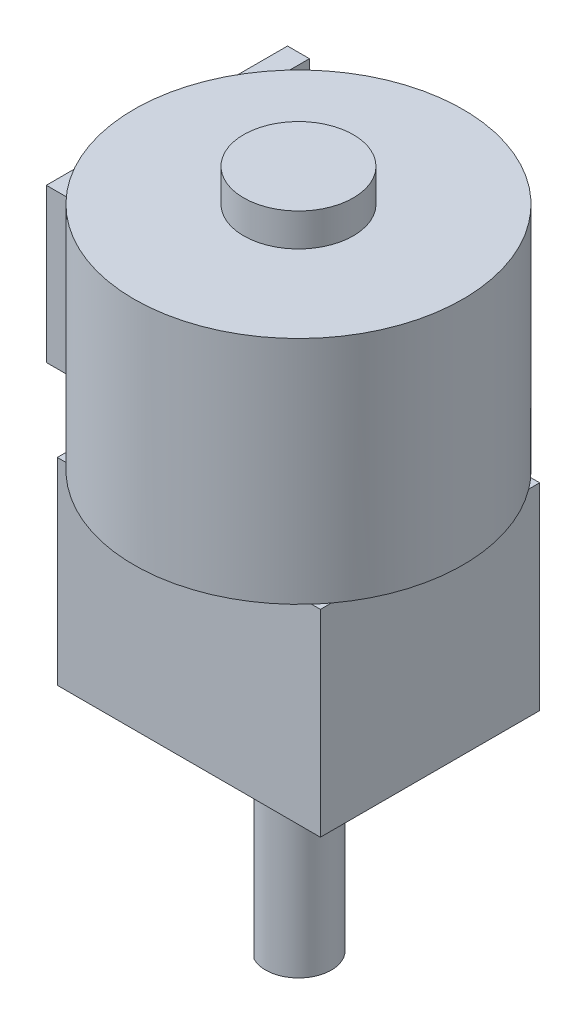
ISO-10303-21;
HEADER;
FILE_DESCRIPTION(('STEP AP214'),'2;1');
FILE_NAME('part.step','',(''),(''),'','','');
FILE_SCHEMA(('AUTOMOTIVE_DESIGN { 1 0 10303 214 1 1 1 1 }'));
ENDSEC;
DATA;
#1=APPLICATION_CONTEXT('core data for automotive mechanical design processes');
#2=APPLICATION_PROTOCOL_DEFINITION('international standard','automotive_design',2000,#1);
#3=PRODUCT_CONTEXT('',#1,'mechanical');
#4=PRODUCT('Part','Part','',(#3));
#5=PRODUCT_RELATED_PRODUCT_CATEGORY('part','',(#4));
#6=PRODUCT_DEFINITION_FORMATION('','',#4);
#7=PRODUCT_DEFINITION_CONTEXT('part definition',#1,'design');
#8=PRODUCT_DEFINITION('design','',#6,#7);
#9=PRODUCT_DEFINITION_SHAPE('','',#8);
#10=(LENGTH_UNIT() NAMED_UNIT(*) SI_UNIT(.MILLI.,.METRE.));
#11=(NAMED_UNIT(*) PLANE_ANGLE_UNIT() SI_UNIT($,.RADIAN.));
#12=(NAMED_UNIT(*) SI_UNIT($,.STERADIAN.) SOLID_ANGLE_UNIT());
#13=UNCERTAINTY_MEASURE_WITH_UNIT(LENGTH_MEASURE(1.E-05),#10,'distance_accuracy_value','');
#14=(GEOMETRIC_REPRESENTATION_CONTEXT(3) GLOBAL_UNCERTAINTY_ASSIGNED_CONTEXT((#13)) GLOBAL_UNIT_ASSIGNED_CONTEXT((#10,
#11,#12)) REPRESENTATION_CONTEXT('',''));
#15=CARTESIAN_POINT('',(0.,0.,0.));
#16=DIRECTION('',(0.,0.,1.));
#17=DIRECTION('',(1.,0.,0.));
#18=AXIS2_PLACEMENT_3D('',#15,#16,#17);
#19=CARTESIAN_POINT('',(-8.5,17.5,3.));
#20=DIRECTION('',(1.,0.,0.));
#21=DIRECTION('',(0.,0.,-1.));
#22=AXIS2_PLACEMENT_3D('',#19,#20,#21);
#23=PLANE('',#22);
#24=DIRECTION('',(0.,0.,1.));
#25=VECTOR('',#24,1.);
#26=CARTESIAN_POINT('',(-8.5,10.5,3.));
#27=LINE('',#26,#25);
#28=CARTESIAN_POINT('',(-8.5,10.5,-8.));
#29=VERTEX_POINT('',#28);
#30=CARTESIAN_POINT('',(-8.5,10.5,3.));
#31=VERTEX_POINT('',#30);
#32=EDGE_CURVE('E115',#29,#31,#27,.T.);
#33=ORIENTED_EDGE('',*,*,#32,.T.);
#34=DIRECTION('',(0.,-1.,0.));
#35=VECTOR('',#34,1.);
#36=CARTESIAN_POINT('',(-8.5,17.5,3.));
#37=LINE('',#36,#35);
#38=CARTESIAN_POINT('',(-8.5,17.5,3.));
#39=VERTEX_POINT('',#38);
#40=EDGE_CURVE('E12',#39,#31,#37,.T.);
#41=ORIENTED_EDGE('',*,*,#40,.F.);
#42=DIRECTION('',(0.,0.,1.));
#43=VECTOR('',#42,1.);
#44=CARTESIAN_POINT('',(-8.5,17.5,3.));
#45=LINE('',#44,#43);
#46=CARTESIAN_POINT('',(-8.5,17.5,-8.));
#47=VERTEX_POINT('',#46);
#48=EDGE_CURVE('E103',#47,#39,#45,.T.);
#49=ORIENTED_EDGE('',*,*,#48,.F.);
#50=DIRECTION('',(0.,-1.,0.));
#51=VECTOR('',#50,1.);
#52=CARTESIAN_POINT('',(-8.5,17.5,-8.));
#53=LINE('',#52,#51);
#54=EDGE_CURVE('E111',#47,#29,#53,.T.);
#55=ORIENTED_EDGE('',*,*,#54,.T.);
#56=EDGE_LOOP('',(#33,#41,#49,#55));
#57=FACE_BOUND('',#56,.T.);
#58=ADVANCED_FACE('F52',(#57),#23,.F.);
#59=CARTESIAN_POINT('',(-8.5,17.5,3.));
#60=DIRECTION('',(0.,0.,-1.));
#61=DIRECTION('',(-1.,0.,0.));
#62=AXIS2_PLACEMENT_3D('',#59,#60,#61);
#63=PLANE('',#62);
#64=DIRECTION('',(1.,0.,0.));
#65=VECTOR('',#64,1.);
#66=CARTESIAN_POINT('',(-8.5,10.5,3.));
#67=LINE('',#66,#65);
#68=CARTESIAN_POINT('',(-7.5,10.5,3.));
#69=VERTEX_POINT('',#68);
#70=EDGE_CURVE('E107',#31,#69,#67,.T.);
#71=ORIENTED_EDGE('',*,*,#70,.T.);
#72=DIRECTION('',(0.,-1.,0.));
#73=VECTOR('',#72,1.);
#74=CARTESIAN_POINT('',(-7.5,17.5,3.));
#75=LINE('',#74,#73);
#76=CARTESIAN_POINT('',(-7.5,17.5,3.));
#77=VERTEX_POINT('',#76);
#78=EDGE_CURVE('E60',#77,#69,#75,.T.);
#79=ORIENTED_EDGE('',*,*,#78,.F.);
#80=DIRECTION('',(1.,0.,0.));
#81=VECTOR('',#80,1.);
#82=CARTESIAN_POINT('',(-8.5,17.5,3.));
#83=LINE('',#82,#81);
#84=EDGE_CURVE('E98',#39,#77,#83,.T.);
#85=ORIENTED_EDGE('',*,*,#84,.F.);
#86=ORIENTED_EDGE('',*,*,#40,.T.);
#87=EDGE_LOOP('',(#71,#79,#85,#86));
#88=FACE_BOUND('',#87,.T.);
#89=ADVANCED_FACE('F106',(#88),#63,.F.);
#90=CARTESIAN_POINT('',(-7.5,17.5,3.));
#91=DIRECTION('',(-1.,0.,0.));
#92=DIRECTION('',(0.,0.,1.));
#93=AXIS2_PLACEMENT_3D('',#90,#91,#92);
#94=PLANE('',#93);
#95=DIRECTION('',(0.,0.,-1.));
#96=VECTOR('',#95,1.);
#97=CARTESIAN_POINT('',(-7.5,10.5,3.));
#98=LINE('',#97,#96);
#99=CARTESIAN_POINT('',(-7.5,10.5,-8.));
#100=VERTEX_POINT('',#99);
#101=EDGE_CURVE('E85',#69,#100,#98,.T.);
#102=ORIENTED_EDGE('',*,*,#101,.T.);
#103=DIRECTION('',(0.,-1.,0.));
#104=VECTOR('',#103,1.);
#105=CARTESIAN_POINT('',(-7.5,17.5,-8.));
#106=LINE('',#105,#104);
#107=CARTESIAN_POINT('',(-7.5,17.5,-8.));
#108=VERTEX_POINT('',#107);
#109=EDGE_CURVE('E108',#108,#100,#106,.T.);
#110=ORIENTED_EDGE('',*,*,#109,.F.);
#111=DIRECTION('',(0.,0.,-1.));
#112=VECTOR('',#111,1.);
#113=CARTESIAN_POINT('',(-7.5,17.5,3.));
#114=LINE('',#113,#112);
#115=EDGE_CURVE('E101',#77,#108,#114,.T.);
#116=ORIENTED_EDGE('',*,*,#115,.F.);
#117=ORIENTED_EDGE('',*,*,#78,.T.);
#118=EDGE_LOOP('',(#102,#110,#116,#117));
#119=FACE_BOUND('',#118,.T.);
#120=ADVANCED_FACE('F109',(#119),#94,.F.);
#121=CARTESIAN_POINT('',(-8.5,17.5,-8.));
#122=DIRECTION('',(0.,0.,1.));
#123=DIRECTION('',(1.,0.,0.));
#124=AXIS2_PLACEMENT_3D('',#121,#122,#123);
#125=PLANE('',#124);
#126=DIRECTION('',(-1.,0.,0.));
#127=VECTOR('',#126,1.);
#128=CARTESIAN_POINT('',(-8.5,10.5,-8.));
#129=LINE('',#128,#127);
#130=EDGE_CURVE('E91',#100,#29,#129,.T.);
#131=ORIENTED_EDGE('',*,*,#130,.T.);
#132=ORIENTED_EDGE('',*,*,#54,.F.);
#133=DIRECTION('',(-1.,0.,0.));
#134=VECTOR('',#133,1.);
#135=CARTESIAN_POINT('',(-8.5,17.5,-8.));
#136=LINE('',#135,#134);
#137=EDGE_CURVE('E68',#108,#47,#136,.T.);
#138=ORIENTED_EDGE('',*,*,#137,.F.);
#139=ORIENTED_EDGE('',*,*,#109,.T.);
#140=EDGE_LOOP('',(#131,#132,#138,#139));
#141=FACE_BOUND('',#140,.T.);
#142=ADVANCED_FACE('F122',(#141),#125,.F.);
#143=CARTESIAN_POINT('',(0.,17.5,0.));
#144=DIRECTION('',(0.,-1.,0.));
#145=DIRECTION('',(0.,0.,-1.));
#146=AXIS2_PLACEMENT_3D('',#143,#144,#145);
#147=PLANE('',#146);
#148=ORIENTED_EDGE('',*,*,#48,.T.);
#149=ORIENTED_EDGE('',*,*,#84,.T.);
#150=ORIENTED_EDGE('',*,*,#115,.T.);
#151=ORIENTED_EDGE('',*,*,#137,.T.);
#152=EDGE_LOOP('',(#148,#149,#150,#151));
#153=FACE_BOUND('',#152,.T.);
#154=ADVANCED_FACE('F99',(#153),#147,.F.);
#155=CARTESIAN_POINT('',(0.,10.5,0.));
#156=DIRECTION('',(0.,-1.,0.));
#157=DIRECTION('',(0.,0.,-1.));
#158=AXIS2_PLACEMENT_3D('',#155,#156,#157);
#159=PLANE('',#158);
#160=ORIENTED_EDGE('',*,*,#32,.F.);
#161=ORIENTED_EDGE('',*,*,#130,.F.);
#162=ORIENTED_EDGE('',*,*,#101,.F.);
#163=ORIENTED_EDGE('',*,*,#70,.F.);
#164=EDGE_LOOP('',(#160,#161,#162,#163));
#165=FACE_BOUND('',#164,.T.);
#166=ADVANCED_FACE('F125',(#165),#159,.T.);
#167=CLOSED_SHELL('',(#58,#89,#120,#142,#154,#166));
#168=MANIFOLD_SOLID_BREP('B2',#167);
#169=CARTESIAN_POINT('',(0.,9.,0.));
#170=DIRECTION('',(0.,1.,0.));
#171=DIRECTION('',(0.,0.,1.));
#172=AXIS2_PLACEMENT_3D('',#169,#170,#171);
#173=PLANE('',#172);
#174=CARTESIAN_POINT('',(0.,9.,0.));
#175=DIRECTION('',(0.,1.,0.));
#176=DIRECTION('',(0.,0.,1.));
#177=AXIS2_PLACEMENT_3D('',#174,#175,#176);
#178=CIRCLE('',#177,7.5);
#179=CARTESIAN_POINT('',(5.59016994374947,9.,5.));
#180=VERTEX_POINT('',#179);
#181=CARTESIAN_POINT('',(6.,9.,4.5));
#182=VERTEX_POINT('',#181);
#183=EDGE_CURVE('E296',#180,#182,#178,.T.);
#184=ORIENTED_EDGE('',*,*,#183,.F.);
#185=DIRECTION('',(1.,0.,0.));
#186=VECTOR('',#185,1.);
#187=CARTESIAN_POINT('',(-6.,9.,5.));
#188=LINE('',#187,#186);
#189=CARTESIAN_POINT('',(6.,9.,5.));
#190=VERTEX_POINT('',#189);
#191=EDGE_CURVE('E279',#180,#190,#188,.T.);
#192=ORIENTED_EDGE('',*,*,#191,.T.);
#193=DIRECTION('',(0.,0.,-1.));
#194=VECTOR('',#193,1.);
#195=CARTESIAN_POINT('',(6.,9.,-5.));
#196=LINE('',#195,#194);
#197=EDGE_CURVE('E338',#190,#182,#196,.T.);
#198=ORIENTED_EDGE('',*,*,#197,.T.);
#199=EDGE_LOOP('',(#184,#192,#198));
#200=FACE_BOUND('',#199,.T.);
#201=ADVANCED_FACE('F178',(#200),#173,.T.);
#202=CARTESIAN_POINT('',(6.,9.,-4.5));
#203=VERTEX_POINT('',#202);
#204=CARTESIAN_POINT('',(5.59016994374947,9.,-5.));
#205=VERTEX_POINT('',#204);
#206=EDGE_CURVE('E188',#203,#205,#178,.T.);
#207=ORIENTED_EDGE('',*,*,#206,.F.);
#208=CARTESIAN_POINT('',(6.,9.,-5.));
#209=VERTEX_POINT('',#208);
#210=EDGE_CURVE('E276',#203,#209,#196,.T.);
#211=ORIENTED_EDGE('',*,*,#210,.T.);
#212=DIRECTION('',(-1.,0.,0.));
#213=VECTOR('',#212,1.);
#214=CARTESIAN_POINT('',(-6.,9.,-5.));
#215=LINE('',#214,#213);
#216=EDGE_CURVE('E327',#209,#205,#215,.T.);
#217=ORIENTED_EDGE('',*,*,#216,.T.);
#218=EDGE_LOOP('',(#207,#211,#217));
#219=FACE_BOUND('',#218,.T.);
#220=ADVANCED_FACE('F325',(#219),#173,.T.);
#221=CARTESIAN_POINT('',(-5.59016994374947,9.,-5.));
#222=VERTEX_POINT('',#221);
#223=CARTESIAN_POINT('',(-6.,9.,-4.5));
#224=VERTEX_POINT('',#223);
#225=EDGE_CURVE('E196',#222,#224,#178,.T.);
#226=ORIENTED_EDGE('',*,*,#225,.F.);
#227=CARTESIAN_POINT('',(-6.,9.,-5.));
#228=VERTEX_POINT('',#227);
#229=EDGE_CURVE('E343',#222,#228,#215,.T.);
#230=ORIENTED_EDGE('',*,*,#229,.T.);
#231=DIRECTION('',(0.,0.,1.));
#232=VECTOR('',#231,1.);
#233=CARTESIAN_POINT('',(-6.,9.,-5.));
#234=LINE('',#233,#232);
#235=EDGE_CURVE('E380',#228,#224,#234,.T.);
#236=ORIENTED_EDGE('',*,*,#235,.T.);
#237=EDGE_LOOP('',(#226,#230,#236));
#238=FACE_BOUND('',#237,.T.);
#239=ADVANCED_FACE('F456',(#238),#173,.T.);
#240=CARTESIAN_POINT('',(-6.,9.,-5.));
#241=DIRECTION('',(1.,0.,0.));
#242=DIRECTION('',(0.,0.,-1.));
#243=AXIS2_PLACEMENT_3D('',#240,#241,#242);
#244=PLANE('',#243);
#245=DIRECTION('',(0.,0.,1.));
#246=VECTOR('',#245,1.);
#247=CARTESIAN_POINT('',(-6.,0.,-5.));
#248=LINE('',#247,#246);
#249=CARTESIAN_POINT('',(-6.,0.,-5.));
#250=VERTEX_POINT('',#249);
#251=CARTESIAN_POINT('',(-6.,0.,5.));
#252=VERTEX_POINT('',#251);
#253=EDGE_CURVE('E349',#250,#252,#248,.T.);
#254=ORIENTED_EDGE('',*,*,#253,.T.);
#255=DIRECTION('',(0.,-1.,0.));
#256=VECTOR('',#255,1.);
#257=CARTESIAN_POINT('',(-6.,9.,5.));
#258=LINE('',#257,#256);
#259=CARTESIAN_POINT('',(-6.,9.,5.));
#260=VERTEX_POINT('',#259);
#261=EDGE_CURVE('E182',#260,#252,#258,.T.);
#262=ORIENTED_EDGE('',*,*,#261,.F.);
#263=CARTESIAN_POINT('',(-6.,9.,4.5));
#264=VERTEX_POINT('',#263);
#265=EDGE_CURVE('E271',#264,#260,#234,.T.);
#266=ORIENTED_EDGE('',*,*,#265,.F.);
#267=EDGE_CURVE('E382',#224,#264,#234,.T.);
#268=ORIENTED_EDGE('',*,*,#267,.F.);
#269=ORIENTED_EDGE('',*,*,#235,.F.);
#270=DIRECTION('',(0.,-1.,0.));
#271=VECTOR('',#270,1.);
#272=CARTESIAN_POINT('',(-6.,9.,-5.));
#273=LINE('',#272,#271);
#274=EDGE_CURVE('E348',#228,#250,#273,.T.);
#275=ORIENTED_EDGE('',*,*,#274,.T.);
#276=EDGE_LOOP('',(#254,#262,#266,#268,#269,#275));
#277=FACE_BOUND('',#276,.T.);
#278=ADVANCED_FACE('F180',(#277),#244,.F.);
#279=CARTESIAN_POINT('',(-6.,9.,5.));
#280=DIRECTION('',(0.,0.,-1.));
#281=DIRECTION('',(-1.,0.,0.));
#282=AXIS2_PLACEMENT_3D('',#279,#280,#281);
#283=PLANE('',#282);
#284=DIRECTION('',(1.,0.,0.));
#285=VECTOR('',#284,1.);
#286=CARTESIAN_POINT('',(-6.,0.,5.));
#287=LINE('',#286,#285);
#288=CARTESIAN_POINT('',(6.,0.,5.));
#289=VERTEX_POINT('',#288);
#290=EDGE_CURVE('E353',#252,#289,#287,.T.);
#291=ORIENTED_EDGE('',*,*,#290,.T.);
#292=DIRECTION('',(0.,-1.,0.));
#293=VECTOR('',#292,1.);
#294=CARTESIAN_POINT('',(6.,9.,5.));
#295=LINE('',#294,#293);
#296=EDGE_CURVE('E367',#190,#289,#295,.T.);
#297=ORIENTED_EDGE('',*,*,#296,.F.);
#298=ORIENTED_EDGE('',*,*,#191,.F.);
#299=CARTESIAN_POINT('',(-5.59016994374947,9.,5.));
#300=VERTEX_POINT('',#299);
#301=EDGE_CURVE('E277',#300,#180,#188,.T.);
#302=ORIENTED_EDGE('',*,*,#301,.F.);
#303=EDGE_CURVE('E265',#260,#300,#188,.T.);
#304=ORIENTED_EDGE('',*,*,#303,.F.);
#305=ORIENTED_EDGE('',*,*,#261,.T.);
#306=EDGE_LOOP('',(#291,#297,#298,#302,#304,#305));
#307=FACE_BOUND('',#306,.T.);
#308=ADVANCED_FACE('F283',(#307),#283,.F.);
#309=CARTESIAN_POINT('',(6.,9.,-5.));
#310=DIRECTION('',(-1.,0.,0.));
#311=DIRECTION('',(0.,0.,1.));
#312=AXIS2_PLACEMENT_3D('',#309,#310,#311);
#313=PLANE('',#312);
#314=DIRECTION('',(0.,0.,-1.));
#315=VECTOR('',#314,1.);
#316=CARTESIAN_POINT('',(6.,0.,-5.));
#317=LINE('',#316,#315);
#318=CARTESIAN_POINT('',(6.,0.,-5.));
#319=VERTEX_POINT('',#318);
#320=EDGE_CURVE('E357',#289,#319,#317,.T.);
#321=ORIENTED_EDGE('',*,*,#320,.T.);
#322=DIRECTION('',(0.,-1.,0.));
#323=VECTOR('',#322,1.);
#324=CARTESIAN_POINT('',(6.,9.,-5.));
#325=LINE('',#324,#323);
#326=EDGE_CURVE('E335',#209,#319,#325,.T.);
#327=ORIENTED_EDGE('',*,*,#326,.F.);
#328=ORIENTED_EDGE('',*,*,#210,.F.);
#329=EDGE_CURVE('E332',#182,#203,#196,.T.);
#330=ORIENTED_EDGE('',*,*,#329,.F.);
#331=ORIENTED_EDGE('',*,*,#197,.F.);
#332=ORIENTED_EDGE('',*,*,#296,.T.);
#333=EDGE_LOOP('',(#321,#327,#328,#330,#331,#332));
#334=FACE_BOUND('',#333,.T.);
#335=ADVANCED_FACE('F330',(#334),#313,.F.);
#336=CARTESIAN_POINT('',(-6.,9.,-5.));
#337=DIRECTION('',(0.,0.,1.));
#338=DIRECTION('',(1.,0.,0.));
#339=AXIS2_PLACEMENT_3D('',#336,#337,#338);
#340=PLANE('',#339);
#341=DIRECTION('',(-1.,0.,0.));
#342=VECTOR('',#341,1.);
#343=CARTESIAN_POINT('',(-6.,0.,-5.));
#344=LINE('',#343,#342);
#345=EDGE_CURVE('E360',#319,#250,#344,.T.);
#346=ORIENTED_EDGE('',*,*,#345,.T.);
#347=ORIENTED_EDGE('',*,*,#274,.F.);
#348=ORIENTED_EDGE('',*,*,#229,.F.);
#349=EDGE_CURVE('E203',#205,#222,#215,.T.);
#350=ORIENTED_EDGE('',*,*,#349,.F.);
#351=ORIENTED_EDGE('',*,*,#216,.F.);
#352=ORIENTED_EDGE('',*,*,#326,.T.);
#353=EDGE_LOOP('',(#346,#347,#348,#350,#351,#352));
#354=FACE_BOUND('',#353,.T.);
#355=ADVANCED_FACE('F379',(#354),#340,.F.);
#356=EDGE_CURVE('E269',#264,#300,#178,.T.);
#357=ORIENTED_EDGE('',*,*,#356,.F.);
#358=ORIENTED_EDGE('',*,*,#265,.T.);
#359=ORIENTED_EDGE('',*,*,#303,.T.);
#360=EDGE_LOOP('',(#357,#358,#359));
#361=FACE_BOUND('',#360,.T.);
#362=ADVANCED_FACE('F267',(#361),#173,.T.);
#363=CARTESIAN_POINT('',(0.,0.,0.));
#364=DIRECTION('',(0.,1.,0.));
#365=DIRECTION('',(0.,0.,1.));
#366=AXIS2_PLACEMENT_3D('',#363,#364,#365);
#367=PLANE('',#366);
#368=CARTESIAN_POINT('',(-4.5,0.,0.));
#369=DIRECTION('',(0.,-1.,0.));
#370=DIRECTION('',(0.,0.,-1.));
#371=AXIS2_PLACEMENT_3D('',#368,#369,#370);
#372=CIRCLE('',#371,0.899999999999989);
#373=CARTESIAN_POINT('',(-4.5,0.,-0.899999999999989));
#374=VERTEX_POINT('',#373);
#375=EDGE_CURVE('E315',#374,#374,#372,.T.);
#376=ORIENTED_EDGE('',*,*,#375,.F.);
#377=EDGE_LOOP('',(#376));
#378=FACE_BOUND('',#377,.T.);
#379=CARTESIAN_POINT('',(4.5,0.,0.));
#380=DIRECTION('',(0.,-1.,0.));
#381=DIRECTION('',(0.,0.,-1.));
#382=AXIS2_PLACEMENT_3D('',#379,#380,#381);
#383=CIRCLE('',#382,0.899999999999989);
#384=CARTESIAN_POINT('',(4.5,0.,-0.899999999999989));
#385=VERTEX_POINT('',#384);
#386=EDGE_CURVE('E417',#385,#385,#383,.T.);
#387=ORIENTED_EDGE('',*,*,#386,.F.);
#388=EDGE_LOOP('',(#387));
#389=FACE_BOUND('',#388,.T.);
#390=CARTESIAN_POINT('',(0.,0.,0.));
#391=DIRECTION('',(0.,-1.,0.));
#392=DIRECTION('',(0.,0.,-1.));
#393=AXIS2_PLACEMENT_3D('',#390,#391,#392);
#394=CIRCLE('',#393,2.);
#395=CARTESIAN_POINT('',(0.,0.,-2.));
#396=VERTEX_POINT('',#395);
#397=EDGE_CURVE('E301',#396,#396,#394,.T.);
#398=ORIENTED_EDGE('',*,*,#397,.F.);
#399=EDGE_LOOP('',(#398));
#400=FACE_BOUND('',#399,.T.);
#401=ORIENTED_EDGE('',*,*,#253,.F.);
#402=ORIENTED_EDGE('',*,*,#345,.F.);
#403=ORIENTED_EDGE('',*,*,#320,.F.);
#404=ORIENTED_EDGE('',*,*,#290,.F.);
#405=EDGE_LOOP('',(#401,#402,#403,#404));
#406=FACE_BOUND('',#405,.T.);
#407=ADVANCED_FACE('F378',(#378,#389,#400,#406),#367,.F.);
#408=CARTESIAN_POINT('',(0.,-1.,0.));
#409=DIRECTION('',(0.,1.,0.));
#410=DIRECTION('',(0.,0.,1.));
#411=AXIS2_PLACEMENT_3D('',#408,#409,#410);
#412=CYLINDRICAL_SURFACE('',#411,2.);
#413=CARTESIAN_POINT('',(0.,-1.,0.));
#414=DIRECTION('',(0.,-1.,0.));
#415=DIRECTION('',(0.,0.,-1.));
#416=AXIS2_PLACEMENT_3D('',#413,#414,#415);
#417=CIRCLE('',#416,2.);
#418=CARTESIAN_POINT('',(0.,-1.,-2.));
#419=VERTEX_POINT('',#418);
#420=EDGE_CURVE('E354',#419,#419,#417,.T.);
#421=ORIENTED_EDGE('',*,*,#420,.F.);
#422=EDGE_LOOP('',(#421));
#423=FACE_BOUND('',#422,.T.);
#424=ORIENTED_EDGE('',*,*,#397,.T.);
#425=EDGE_LOOP('',(#424));
#426=FACE_BOUND('',#425,.T.);
#427=ADVANCED_FACE('F433',(#423,#426),#412,.T.);
#428=CARTESIAN_POINT('',(0.,-1.,0.));
#429=DIRECTION('',(0.,-1.,0.));
#430=DIRECTION('',(0.,0.,-1.));
#431=AXIS2_PLACEMENT_3D('',#428,#429,#430);
#432=PLANE('',#431);
#433=CARTESIAN_POINT('',(0.,-1.,0.));
#434=DIRECTION('',(0.,-1.,0.));
#435=DIRECTION('',(0.,0.,-1.));
#436=AXIS2_PLACEMENT_3D('',#433,#434,#435);
#437=CIRCLE('',#436,1.5);
#438=CARTESIAN_POINT('',(-0.7,-1.,-1.32664991614216));
#439=VERTEX_POINT('',#438);
#440=CARTESIAN_POINT('',(-0.7,-1.,1.32664991614216));
#441=VERTEX_POINT('',#440);
#442=EDGE_CURVE('E409',#439,#441,#437,.T.);
#443=ORIENTED_EDGE('',*,*,#442,.F.);
#444=DIRECTION('',(0.,0.,-1.));
#445=VECTOR('',#444,1.);
#446=CARTESIAN_POINT('',(-0.7,-1.,-1.32664991614216));
#447=LINE('',#446,#445);
#448=EDGE_CURVE('E405',#441,#439,#447,.T.);
#449=ORIENTED_EDGE('',*,*,#448,.F.);
#450=EDGE_LOOP('',(#443,#449));
#451=FACE_BOUND('',#450,.T.);
#452=ORIENTED_EDGE('',*,*,#420,.T.);
#453=EDGE_LOOP('',(#452));
#454=FACE_BOUND('',#453,.T.);
#455=ADVANCED_FACE('F440',(#451,#454),#432,.T.);
#456=CARTESIAN_POINT('',(0.,-10.,0.));
#457=DIRECTION('',(0.,1.,0.));
#458=DIRECTION('',(0.,0.,1.));
#459=AXIS2_PLACEMENT_3D('',#456,#457,#458);
#460=CYLINDRICAL_SURFACE('',#459,1.5);
#461=ORIENTED_EDGE('',*,*,#442,.T.);
#462=DIRECTION('',(0.,1.,0.));
#463=VECTOR('',#462,1.);
#464=CARTESIAN_POINT('',(-0.7,-10.,1.32664991614216));
#465=LINE('',#464,#463);
#466=CARTESIAN_POINT('',(-0.7,-10.,1.32664991614216));
#467=VERTEX_POINT('',#466);
#468=EDGE_CURVE('E390',#467,#441,#465,.T.);
#469=ORIENTED_EDGE('',*,*,#468,.F.);
#470=CARTESIAN_POINT('',(0.,-10.,0.));
#471=DIRECTION('',(0.,-1.,0.));
#472=DIRECTION('',(0.,0.,-1.));
#473=AXIS2_PLACEMENT_3D('',#470,#471,#472);
#474=CIRCLE('',#473,1.5);
#475=CARTESIAN_POINT('',(-0.7,-10.,-1.32664991614216));
#476=VERTEX_POINT('',#475);
#477=EDGE_CURVE('E401',#476,#467,#474,.T.);
#478=ORIENTED_EDGE('',*,*,#477,.F.);
#479=DIRECTION('',(0.,1.,0.));
#480=VECTOR('',#479,1.);
#481=CARTESIAN_POINT('',(-0.7,-10.,-1.32664991614216));
#482=LINE('',#481,#480);
#483=EDGE_CURVE('E394',#476,#439,#482,.T.);
#484=ORIENTED_EDGE('',*,*,#483,.T.);
#485=EDGE_LOOP('',(#461,#469,#478,#484));
#486=FACE_BOUND('',#485,.T.);
#487=ADVANCED_FACE('F446',(#486),#460,.T.);
#488=CARTESIAN_POINT('',(-0.7,-10.,-1.32664991614216));
#489=DIRECTION('',(1.,0.,0.));
#490=DIRECTION('',(0.,0.,-1.));
#491=AXIS2_PLACEMENT_3D('',#488,#489,#490);
#492=PLANE('',#491);
#493=ORIENTED_EDGE('',*,*,#448,.T.);
#494=ORIENTED_EDGE('',*,*,#483,.F.);
#495=DIRECTION('',(0.,0.,-1.));
#496=VECTOR('',#495,1.);
#497=CARTESIAN_POINT('',(-0.7,-10.,-1.32664991614216));
#498=LINE('',#497,#496);
#499=EDGE_CURVE('E398',#467,#476,#498,.T.);
#500=ORIENTED_EDGE('',*,*,#499,.F.);
#501=ORIENTED_EDGE('',*,*,#468,.T.);
#502=EDGE_LOOP('',(#493,#494,#500,#501));
#503=FACE_BOUND('',#502,.T.);
#504=ADVANCED_FACE('F576',(#503),#492,.F.);
#505=CARTESIAN_POINT('',(0.,-10.,0.));
#506=DIRECTION('',(0.,-1.,0.));
#507=DIRECTION('',(0.,0.,-1.));
#508=AXIS2_PLACEMENT_3D('',#505,#506,#507);
#509=PLANE('',#508);
#510=ORIENTED_EDGE('',*,*,#477,.T.);
#511=ORIENTED_EDGE('',*,*,#499,.T.);
#512=EDGE_LOOP('',(#510,#511));
#513=FACE_BOUND('',#512,.T.);
#514=ADVANCED_FACE('F572',(#513),#509,.T.);
#515=CARTESIAN_POINT('',(4.5,2.,0.));
#516=DIRECTION('',(0.,-1.,0.));
#517=DIRECTION('',(0.,0.,-1.));
#518=AXIS2_PLACEMENT_3D('',#515,#516,#517);
#519=CONICAL_SURFACE('',#518,0.899999999999999,1.02974425867665);
#520=CARTESIAN_POINT('',(4.5,2.5407745571248,0.));
#521=VERTEX_POINT('',#520);
#522=VERTEX_LOOP('',#521);
#523=FACE_BOUND('',#522,.T.);
#524=CARTESIAN_POINT('',(4.5,2.,0.));
#525=DIRECTION('',(0.,-1.,0.));
#526=DIRECTION('',(0.,0.,-1.));
#527=AXIS2_PLACEMENT_3D('',#524,#525,#526);
#528=CIRCLE('',#527,0.899999999999999);
#529=CARTESIAN_POINT('',(4.5,2.,-0.899999999999999));
#530=VERTEX_POINT('',#529);
#531=EDGE_CURVE('E413',#530,#530,#528,.T.);
#532=ORIENTED_EDGE('',*,*,#531,.T.);
#533=EDGE_LOOP('',(#532));
#534=FACE_BOUND('',#533,.T.);
#535=ADVANCED_FACE('F568',(#523,#534),#519,.F.);
#536=CARTESIAN_POINT('',(4.5,0.,0.));
#537=DIRECTION('',(0.,-1.,0.));
#538=DIRECTION('',(0.,0.,-1.));
#539=AXIS2_PLACEMENT_3D('',#536,#537,#538);
#540=CYLINDRICAL_SURFACE('',#539,0.899999999999994);
#541=ORIENTED_EDGE('',*,*,#531,.F.);
#542=EDGE_LOOP('',(#541));
#543=FACE_BOUND('',#542,.T.);
#544=ORIENTED_EDGE('',*,*,#386,.T.);
#545=EDGE_LOOP('',(#544));
#546=FACE_BOUND('',#545,.T.);
#547=ADVANCED_FACE('F564',(#543,#546),#540,.F.);
#548=CARTESIAN_POINT('',(-4.5,2.,0.));
#549=DIRECTION('',(0.,-1.,0.));
#550=DIRECTION('',(0.,0.,-1.));
#551=AXIS2_PLACEMENT_3D('',#548,#549,#550);
#552=CONICAL_SURFACE('',#551,0.899999999999999,1.02974425867665);
#553=CARTESIAN_POINT('',(-4.5,2.5407745571248,0.));
#554=VERTEX_POINT('',#553);
#555=VERTEX_LOOP('',#554);
#556=FACE_BOUND('',#555,.T.);
#557=CARTESIAN_POINT('',(-4.5,2.,0.));
#558=DIRECTION('',(0.,-1.,0.));
#559=DIRECTION('',(0.,0.,-1.));
#560=AXIS2_PLACEMENT_3D('',#557,#558,#559);
#561=CIRCLE('',#560,0.899999999999999);
#562=CARTESIAN_POINT('',(-4.5,2.,-0.899999999999999));
#563=VERTEX_POINT('',#562);
#564=EDGE_CURVE('E421',#563,#563,#561,.T.);
#565=ORIENTED_EDGE('',*,*,#564,.T.);
#566=EDGE_LOOP('',(#565));
#567=FACE_BOUND('',#566,.T.);
#568=ADVANCED_FACE('F560',(#556,#567),#552,.F.);
#569=CARTESIAN_POINT('',(-4.5,0.,0.));
#570=DIRECTION('',(0.,-1.,0.));
#571=DIRECTION('',(0.,0.,-1.));
#572=AXIS2_PLACEMENT_3D('',#569,#570,#571);
#573=CYLINDRICAL_SURFACE('',#572,0.899999999999994);
#574=ORIENTED_EDGE('',*,*,#564,.F.);
#575=EDGE_LOOP('',(#574));
#576=FACE_BOUND('',#575,.T.);
#577=ORIENTED_EDGE('',*,*,#375,.T.);
#578=EDGE_LOOP('',(#577));
#579=FACE_BOUND('',#578,.T.);
#580=ADVANCED_FACE('F429',(#576,#579),#573,.F.);
#581=CARTESIAN_POINT('',(0.,9.,0.));
#582=DIRECTION('',(0.,1.,0.));
#583=DIRECTION('',(0.,0.,1.));
#584=AXIS2_PLACEMENT_3D('',#581,#582,#583);
#585=PLANE('',#584);
#586=EDGE_CURVE('E293',#224,#264,#178,.T.);
#587=ORIENTED_EDGE('',*,*,#586,.F.);
#588=ORIENTED_EDGE('',*,*,#267,.T.);
#589=EDGE_LOOP('',(#587,#588));
#590=FACE_BOUND('',#589,.T.);
#591=ADVANCED_FACE('F489',(#590),#585,.F.);
#592=EDGE_CURVE('E288',#300,#180,#178,.T.);
#593=ORIENTED_EDGE('',*,*,#592,.F.);
#594=ORIENTED_EDGE('',*,*,#301,.T.);
#595=EDGE_LOOP('',(#593,#594));
#596=FACE_BOUND('',#595,.T.);
#597=ADVANCED_FACE('F289',(#596),#585,.F.);
#598=EDGE_CURVE('E310',#182,#203,#178,.T.);
#599=ORIENTED_EDGE('',*,*,#598,.F.);
#600=ORIENTED_EDGE('',*,*,#329,.T.);
#601=EDGE_LOOP('',(#599,#600));
#602=FACE_BOUND('',#601,.T.);
#603=ADVANCED_FACE('F340',(#602),#585,.F.);
#604=EDGE_CURVE('E316',#205,#222,#178,.T.);
#605=ORIENTED_EDGE('',*,*,#604,.F.);
#606=ORIENTED_EDGE('',*,*,#349,.T.);
#607=EDGE_LOOP('',(#605,#606));
#608=FACE_BOUND('',#607,.T.);
#609=ADVANCED_FACE('F496',(#608),#585,.F.);
#610=CARTESIAN_POINT('',(0.,19.5,0.));
#611=DIRECTION('',(0.,-1.,0.));
#612=DIRECTION('',(0.,0.,-1.));
#613=AXIS2_PLACEMENT_3D('',#610,#611,#612);
#614=CYLINDRICAL_SURFACE('',#613,7.5);
#615=CARTESIAN_POINT('',(0.,19.5,0.));
#616=DIRECTION('',(0.,1.,0.));
#617=DIRECTION('',(0.,0.,1.));
#618=AXIS2_PLACEMENT_3D('',#615,#616,#617);
#619=CIRCLE('',#618,7.5);
#620=CARTESIAN_POINT('',(0.,19.5,7.5));
#621=VERTEX_POINT('',#620);
#622=EDGE_CURVE('E309',#621,#621,#619,.T.);
#623=ORIENTED_EDGE('',*,*,#622,.F.);
#624=EDGE_LOOP('',(#623));
#625=FACE_BOUND('',#624,.T.);
#626=ORIENTED_EDGE('',*,*,#183,.T.);
#627=ORIENTED_EDGE('',*,*,#598,.T.);
#628=ORIENTED_EDGE('',*,*,#206,.T.);
#629=ORIENTED_EDGE('',*,*,#604,.T.);
#630=ORIENTED_EDGE('',*,*,#225,.T.);
#631=ORIENTED_EDGE('',*,*,#586,.T.);
#632=ORIENTED_EDGE('',*,*,#356,.T.);
#633=ORIENTED_EDGE('',*,*,#592,.T.);
#634=EDGE_LOOP('',(#626,#627,#628,#629,#630,#631,#632,#633));
#635=FACE_BOUND('',#634,.T.);
#636=ADVANCED_FACE('F298',(#625,#635),#614,.T.);
#637=CARTESIAN_POINT('',(0.,19.5,0.));
#638=DIRECTION('',(0.,1.,0.));
#639=DIRECTION('',(0.,0.,1.));
#640=AXIS2_PLACEMENT_3D('',#637,#638,#639);
#641=PLANE('',#640);
#642=CARTESIAN_POINT('',(0.,19.5,0.));
#643=DIRECTION('',(0.,1.,0.));
#644=DIRECTION('',(0.,0.,1.));
#645=AXIS2_PLACEMENT_3D('',#642,#643,#644);
#646=CIRCLE('',#645,2.5);
#647=CARTESIAN_POINT('',(0.,19.5,2.5));
#648=VERTEX_POINT('',#647);
#649=EDGE_CURVE('E50',#648,#648,#646,.T.);
#650=ORIENTED_EDGE('',*,*,#649,.F.);
#651=EDGE_LOOP('',(#650));
#652=FACE_BOUND('',#651,.T.);
#653=ORIENTED_EDGE('',*,*,#622,.T.);
#654=EDGE_LOOP('',(#653));
#655=FACE_BOUND('',#654,.T.);
#656=ADVANCED_FACE('F526',(#652,#655),#641,.T.);
#657=CARTESIAN_POINT('',(0.,21.,0.));
#658=DIRECTION('',(0.,-1.,0.));
#659=DIRECTION('',(0.,0.,-1.));
#660=AXIS2_PLACEMENT_3D('',#657,#658,#659);
#661=CYLINDRICAL_SURFACE('',#660,2.5);
#662=CARTESIAN_POINT('',(0.,21.,0.));
#663=DIRECTION('',(0.,1.,0.));
#664=DIRECTION('',(0.,0.,1.));
#665=AXIS2_PLACEMENT_3D('',#662,#663,#664);
#666=CIRCLE('',#665,2.5);
#667=CARTESIAN_POINT('',(0.,21.,2.5));
#668=VERTEX_POINT('',#667);
#669=EDGE_CURVE('E294',#668,#668,#666,.T.);
#670=ORIENTED_EDGE('',*,*,#669,.F.);
#671=EDGE_LOOP('',(#670));
#672=FACE_BOUND('',#671,.T.);
#673=ORIENTED_EDGE('',*,*,#649,.T.);
#674=EDGE_LOOP('',(#673));
#675=FACE_BOUND('',#674,.T.);
#676=ADVANCED_FACE('F531',(#672,#675),#661,.T.);
#677=CARTESIAN_POINT('',(0.,21.,0.));
#678=DIRECTION('',(0.,1.,0.));
#679=DIRECTION('',(0.,0.,1.));
#680=AXIS2_PLACEMENT_3D('',#677,#678,#679);
#681=PLANE('',#680);
#682=ORIENTED_EDGE('',*,*,#669,.T.);
#683=EDGE_LOOP('',(#682));
#684=FACE_BOUND('',#683,.T.);
#685=ADVANCED_FACE('F541',(#684),#681,.T.);
#686=CLOSED_SHELL('',(#201,#220,#239,#278,#308,#335,#355,#362,#407,#427,#455,#487,#504,#514,
#535,#547,#568,#580,#591,#597,#603,#609,#636,#656,#676,#685));
#687=MANIFOLD_SOLID_BREP('B6',#686);
#688=ADVANCED_BREP_SHAPE_REPRESENTATION('',(#18,#168,#687),#14);
#689=SHAPE_DEFINITION_REPRESENTATION(#9,#688);
ENDSEC;
END-ISO-10303-21;
